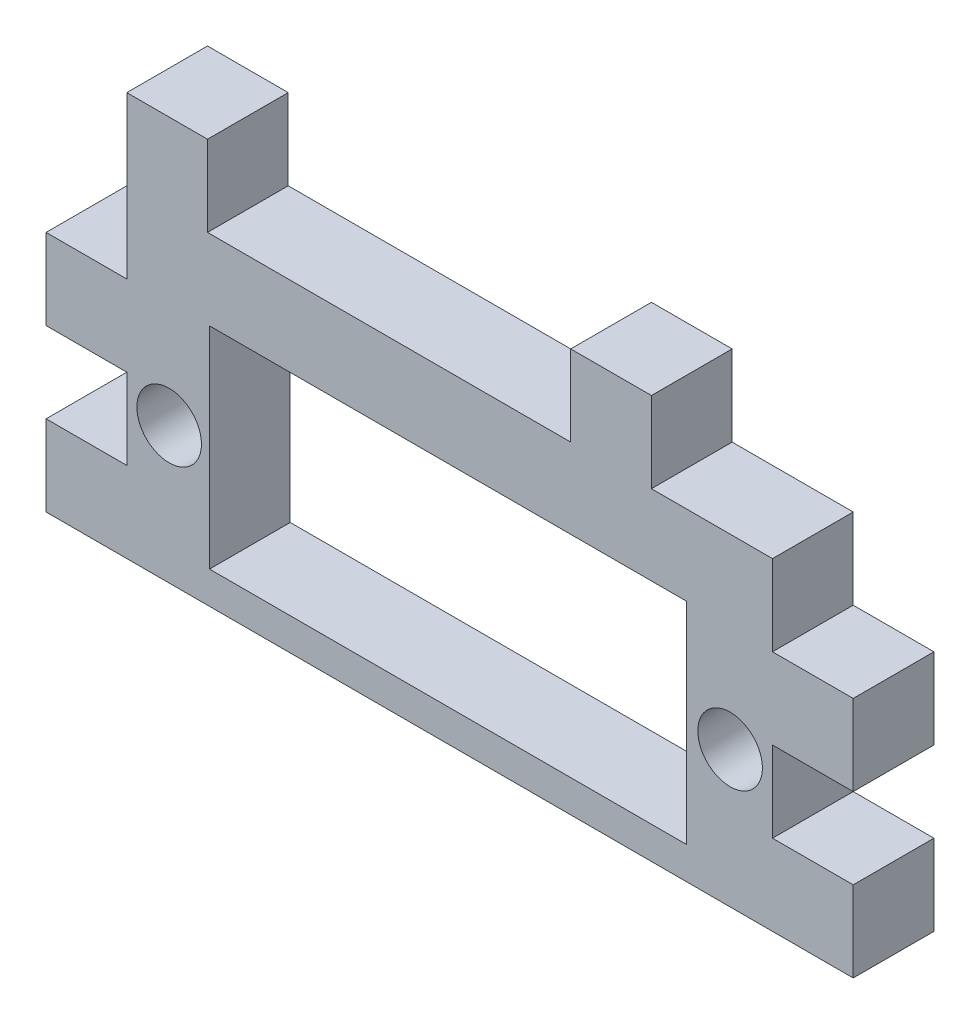
ISO-10303-21;
HEADER;
FILE_DESCRIPTION(('STEP AP214'),'2;1');
FILE_NAME('part.step','',(''),(''),'','','');
FILE_SCHEMA(('AUTOMOTIVE_DESIGN { 1 0 10303 214 1 1 1 1 }'));
ENDSEC;
DATA;
#1=APPLICATION_CONTEXT('core data for automotive mechanical design processes');
#2=APPLICATION_PROTOCOL_DEFINITION('international standard','automotive_design',2000,#1);
#3=PRODUCT_CONTEXT('',#1,'mechanical');
#4=PRODUCT('Part','Part','',(#3));
#5=PRODUCT_RELATED_PRODUCT_CATEGORY('part','',(#4));
#6=PRODUCT_DEFINITION_FORMATION('','',#4);
#7=PRODUCT_DEFINITION_CONTEXT('part definition',#1,'design');
#8=PRODUCT_DEFINITION('design','',#6,#7);
#9=PRODUCT_DEFINITION_SHAPE('','',#8);
#10=(LENGTH_UNIT() NAMED_UNIT(*) SI_UNIT(.MILLI.,.METRE.));
#11=(NAMED_UNIT(*) PLANE_ANGLE_UNIT() SI_UNIT($,.RADIAN.));
#12=(NAMED_UNIT(*) SI_UNIT($,.STERADIAN.) SOLID_ANGLE_UNIT());
#13=UNCERTAINTY_MEASURE_WITH_UNIT(LENGTH_MEASURE(1.E-05),#10,'distance_accuracy_value','');
#14=(GEOMETRIC_REPRESENTATION_CONTEXT(3) GLOBAL_UNCERTAINTY_ASSIGNED_CONTEXT((#13)) GLOBAL_UNIT_ASSIGNED_CONTEXT((#10,
#11,#12)) REPRESENTATION_CONTEXT('',''));
#15=CARTESIAN_POINT('',(0.,0.,0.));
#16=DIRECTION('',(0.,0.,1.));
#17=DIRECTION('',(1.,0.,0.));
#18=AXIS2_PLACEMENT_3D('',#15,#16,#17);
#19=CARTESIAN_POINT('',(-66.021610088224,-17.9075757575758,5.));
#20=DIRECTION('',(0.,-1.,0.));
#21=DIRECTION('',(1.,0.,0.));
#22=AXIS2_PLACEMENT_3D('',#19,#20,#21);
#23=PLANE('',#22);
#24=DIRECTION('',(0.,0.,1.));
#25=VECTOR('',#24,1.);
#26=CARTESIAN_POINT('',(-58.521610088224,-17.9075757575758,0.));
#27=LINE('',#26,#25);
#28=CARTESIAN_POINT('',(-58.521610088224,-17.9075757575758,0.));
#29=VERTEX_POINT('',#28);
#30=CARTESIAN_POINT('',(-58.521610088224,-17.9075757575758,5.));
#31=VERTEX_POINT('',#30);
#32=EDGE_CURVE('E231',#29,#31,#27,.T.);
#33=ORIENTED_EDGE('',*,*,#32,.F.);
#34=DIRECTION('',(-1.,0.,0.));
#35=VECTOR('',#34,1.);
#36=CARTESIAN_POINT('',(-66.021610088224,-17.9075757575758,0.));
#37=LINE('',#36,#35);
#38=CARTESIAN_POINT('',(-81.021610088224,-17.9075757575758,0.));
#39=VERTEX_POINT('',#38);
#40=EDGE_CURVE('E266',#29,#39,#37,.T.);
#41=ORIENTED_EDGE('',*,*,#40,.T.);
#42=DIRECTION('',(0.,0.,-1.));
#43=VECTOR('',#42,1.);
#44=CARTESIAN_POINT('',(-81.021610088224,-17.9075757575758,0.));
#45=LINE('',#44,#43);
#46=CARTESIAN_POINT('',(-81.021610088224,-17.9075757575758,5.));
#47=VERTEX_POINT('',#46);
#48=EDGE_CURVE('E232',#47,#39,#45,.T.);
#49=ORIENTED_EDGE('',*,*,#48,.F.);
#50=DIRECTION('',(-1.,0.,0.));
#51=VECTOR('',#50,1.);
#52=CARTESIAN_POINT('',(-66.021610088224,-17.9075757575758,5.));
#53=LINE('',#52,#51);
#54=EDGE_CURVE('E36',#31,#47,#53,.T.);
#55=ORIENTED_EDGE('',*,*,#54,.F.);
#56=EDGE_LOOP('',(#33,#41,#49,#55));
#57=FACE_BOUND('',#56,.T.);
#58=ADVANCED_FACE('F32',(#57),#23,.F.);
#59=DIRECTION('',(0.,0.,-1.));
#60=VECTOR('',#59,1.);
#61=CARTESIAN_POINT('',(-53.521610088224,-17.9075757575758,0.));
#62=LINE('',#61,#60);
#63=CARTESIAN_POINT('',(-53.521610088224,-17.9075757575758,5.));
#64=VERTEX_POINT('',#63);
#65=CARTESIAN_POINT('',(-53.521610088224,-17.9075757575758,0.));
#66=VERTEX_POINT('',#65);
#67=EDGE_CURVE('E57',#64,#66,#62,.T.);
#68=ORIENTED_EDGE('',*,*,#67,.F.);
#69=CARTESIAN_POINT('',(-46.021610088224,-17.9075757575758,5.));
#70=VERTEX_POINT('',#69);
#71=EDGE_CURVE('E272',#70,#64,#53,.T.);
#72=ORIENTED_EDGE('',*,*,#71,.F.);
#73=DIRECTION('',(0.,0.,-1.));
#74=VECTOR('',#73,1.);
#75=CARTESIAN_POINT('',(-46.021610088224,-17.9075757575758,5.));
#76=LINE('',#75,#74);
#77=CARTESIAN_POINT('',(-46.021610088224,-17.9075757575758,0.));
#78=VERTEX_POINT('',#77);
#79=EDGE_CURVE('E293',#70,#78,#76,.T.);
#80=ORIENTED_EDGE('',*,*,#79,.T.);
#81=EDGE_CURVE('E268',#78,#66,#37,.T.);
#82=ORIENTED_EDGE('',*,*,#81,.T.);
#83=EDGE_LOOP('',(#68,#72,#80,#82));
#84=FACE_BOUND('',#83,.T.);
#85=ADVANCED_FACE('F499',(#84),#23,.F.);
#86=CARTESIAN_POINT('',(0.,0.,5.));
#87=DIRECTION('',(0.,0.,1.));
#88=DIRECTION('',(1.,0.,0.));
#89=AXIS2_PLACEMENT_3D('',#86,#87,#88);
#90=PLANE('',#89);
#91=CARTESIAN_POINT('',(-48.646610088224,-29.4575757575758,5.));
#92=DIRECTION('',(0.,0.,1.));
#93=DIRECTION('',(1.,0.,0.));
#94=AXIS2_PLACEMENT_3D('',#91,#92,#93);
#95=CIRCLE('',#94,2.);
#96=CARTESIAN_POINT('',(-46.646610088224,-29.4575757575758,5.));
#97=VERTEX_POINT('',#96);
#98=EDGE_CURVE('E465',#97,#97,#95,.F.);
#99=ORIENTED_EDGE('',*,*,#98,.T.);
#100=EDGE_LOOP('',(#99));
#101=FACE_BOUND('',#100,.T.);
#102=CARTESIAN_POINT('',(-83.396610088224,-29.4575757575758,5.));
#103=DIRECTION('',(0.,0.,1.));
#104=DIRECTION('',(1.,0.,0.));
#105=AXIS2_PLACEMENT_3D('',#102,#103,#104);
#106=CIRCLE('',#105,2.);
#107=CARTESIAN_POINT('',(-81.396610088224,-29.4575757575758,5.));
#108=VERTEX_POINT('',#107);
#109=EDGE_CURVE('E454',#108,#108,#106,.F.);
#110=ORIENTED_EDGE('',*,*,#109,.T.);
#111=EDGE_LOOP('',(#110));
#112=FACE_BOUND('',#111,.T.);
#113=DIRECTION('',(1.,0.,0.));
#114=VECTOR('',#113,1.);
#115=CARTESIAN_POINT('',(-80.896610088224,-22.8575757575758,5.));
#116=LINE('',#115,#114);
#117=CARTESIAN_POINT('',(-80.896610088224,-22.8575757575758,5.));
#118=VERTEX_POINT('',#117);
#119=CARTESIAN_POINT('',(-51.346610088224,-22.8575757575758,5.));
#120=VERTEX_POINT('',#119);
#121=EDGE_CURVE('E434',#118,#120,#116,.T.);
#122=ORIENTED_EDGE('',*,*,#121,.T.);
#123=DIRECTION('',(0.,-1.,0.));
#124=VECTOR('',#123,1.);
#125=CARTESIAN_POINT('',(-51.346610088224,-35.9075757575758,5.));
#126=LINE('',#125,#124);
#127=CARTESIAN_POINT('',(-51.346610088224,-35.9075757575758,5.));
#128=VERTEX_POINT('',#127);
#129=EDGE_CURVE('E433',#120,#128,#126,.T.);
#130=ORIENTED_EDGE('',*,*,#129,.T.);
#131=DIRECTION('',(-1.,0.,0.));
#132=VECTOR('',#131,1.);
#133=CARTESIAN_POINT('',(-80.896610088224,-35.9075757575758,5.));
#134=LINE('',#133,#132);
#135=CARTESIAN_POINT('',(-80.896610088224,-35.9075757575758,5.));
#136=VERTEX_POINT('',#135);
#137=EDGE_CURVE('E437',#128,#136,#134,.T.);
#138=ORIENTED_EDGE('',*,*,#137,.T.);
#139=DIRECTION('',(0.,1.,0.));
#140=VECTOR('',#139,1.);
#141=CARTESIAN_POINT('',(-80.896610088224,-35.9075757575758,5.));
#142=LINE('',#141,#140);
#143=EDGE_CURVE('E430',#136,#118,#142,.T.);
#144=ORIENTED_EDGE('',*,*,#143,.T.);
#145=EDGE_LOOP('',(#122,#130,#138,#144));
#146=FACE_BOUND('',#145,.T.);
#147=DIRECTION('',(0.,1.,0.));
#148=VECTOR('',#147,1.);
#149=CARTESIAN_POINT('',(-86.021610088224,-17.9075757575758,5.));
#150=LINE('',#149,#148);
#151=CARTESIAN_POINT('',(-86.021610088224,-22.9075757575758,5.));
#152=VERTEX_POINT('',#151);
#153=CARTESIAN_POINT('',(-86.021610088224,-12.9075757575758,5.));
#154=VERTEX_POINT('',#153);
#155=EDGE_CURVE('E423',#152,#154,#150,.T.);
#156=ORIENTED_EDGE('',*,*,#155,.F.);
#157=DIRECTION('',(1.,0.,0.));
#158=VECTOR('',#157,1.);
#159=CARTESIAN_POINT('',(-86.021610088224,-22.9075757575758,5.));
#160=LINE('',#159,#158);
#161=CARTESIAN_POINT('',(-91.021610088224,-22.9075757575758,5.));
#162=VERTEX_POINT('',#161);
#163=EDGE_CURVE('E418',#162,#152,#160,.T.);
#164=ORIENTED_EDGE('',*,*,#163,.F.);
#165=DIRECTION('',(0.,1.,0.));
#166=VECTOR('',#165,1.);
#167=CARTESIAN_POINT('',(-91.021610088224,-12.9075757575758,5.));
#168=LINE('',#167,#166);
#169=CARTESIAN_POINT('',(-91.021610088224,-27.9075757575758,5.));
#170=VERTEX_POINT('',#169);
#171=EDGE_CURVE('E379',#170,#162,#168,.T.);
#172=ORIENTED_EDGE('',*,*,#171,.F.);
#173=DIRECTION('',(-1.,0.,0.));
#174=VECTOR('',#173,1.);
#175=CARTESIAN_POINT('',(-91.0216100882241,-27.9075757575758,5.));
#176=LINE('',#175,#174);
#177=CARTESIAN_POINT('',(-86.0216100882241,-27.9075757575758,5.));
#178=VERTEX_POINT('',#177);
#179=EDGE_CURVE('E405',#178,#170,#176,.T.);
#180=ORIENTED_EDGE('',*,*,#179,.F.);
#181=DIRECTION('',(0.,1.,0.));
#182=VECTOR('',#181,1.);
#183=CARTESIAN_POINT('',(-86.021610088224,-32.9075757575758,5.));
#184=LINE('',#183,#182);
#185=CARTESIAN_POINT('',(-86.021610088224,-32.9075757575758,5.));
#186=VERTEX_POINT('',#185);
#187=EDGE_CURVE('E402',#186,#178,#184,.T.);
#188=ORIENTED_EDGE('',*,*,#187,.F.);
#189=DIRECTION('',(1.,0.,0.));
#190=VECTOR('',#189,1.);
#191=CARTESIAN_POINT('',(-91.0216100882241,-32.9075757575758,5.));
#192=LINE('',#191,#190);
#193=CARTESIAN_POINT('',(-91.0216100882241,-32.9075757575758,5.));
#194=VERTEX_POINT('',#193);
#195=EDGE_CURVE('E397',#194,#186,#192,.T.);
#196=ORIENTED_EDGE('',*,*,#195,.F.);
#197=CARTESIAN_POINT('',(-91.021610088224,-37.9075757575758,5.));
#198=VERTEX_POINT('',#197);
#199=EDGE_CURVE('E367',#198,#194,#168,.T.);
#200=ORIENTED_EDGE('',*,*,#199,.F.);
#201=DIRECTION('',(1.,0.,0.));
#202=VECTOR('',#201,1.);
#203=CARTESIAN_POINT('',(-66.021610088224,-37.9075757575758,5.));
#204=LINE('',#203,#202);
#205=CARTESIAN_POINT('',(-41.021610088224,-37.9075757575758,5.));
#206=VERTEX_POINT('',#205);
#207=EDGE_CURVE('E323',#198,#206,#204,.T.);
#208=ORIENTED_EDGE('',*,*,#207,.T.);
#209=DIRECTION('',(0.,1.,0.));
#210=VECTOR('',#209,1.);
#211=CARTESIAN_POINT('',(-41.021610088224,-12.9075757575758,5.));
#212=LINE('',#211,#210);
#213=CARTESIAN_POINT('',(-41.021610088224,-32.9075757575758,5.));
#214=VERTEX_POINT('',#213);
#215=EDGE_CURVE('E42',#206,#214,#212,.T.);
#216=ORIENTED_EDGE('',*,*,#215,.T.);
#217=DIRECTION('',(-1.,0.,0.));
#218=VECTOR('',#217,1.);
#219=CARTESIAN_POINT('',(-41.021610088224,-32.9075757575758,5.));
#220=LINE('',#219,#218);
#221=CARTESIAN_POINT('',(-46.021610088224,-32.9075757575758,5.));
#222=VERTEX_POINT('',#221);
#223=EDGE_CURVE('E297',#214,#222,#220,.T.);
#224=ORIENTED_EDGE('',*,*,#223,.T.);
#225=DIRECTION('',(0.,1.,0.));
#226=VECTOR('',#225,1.);
#227=CARTESIAN_POINT('',(-46.021610088224,-32.9075757575758,5.));
#228=LINE('',#227,#226);
#229=CARTESIAN_POINT('',(-46.021610088224,-27.9075757575758,5.));
#230=VERTEX_POINT('',#229);
#231=EDGE_CURVE('E300',#222,#230,#228,.T.);
#232=ORIENTED_EDGE('',*,*,#231,.T.);
#233=DIRECTION('',(1.,0.,0.));
#234=VECTOR('',#233,1.);
#235=CARTESIAN_POINT('',(-41.021610088224,-27.9075757575758,5.));
#236=LINE('',#235,#234);
#237=CARTESIAN_POINT('',(-41.021610088224,-27.9075757575758,5.));
#238=VERTEX_POINT('',#237);
#239=EDGE_CURVE('E304',#230,#238,#236,.T.);
#240=ORIENTED_EDGE('',*,*,#239,.T.);
#241=CARTESIAN_POINT('',(-41.021610088224,-22.9075757575758,5.));
#242=VERTEX_POINT('',#241);
#243=EDGE_CURVE('E325',#238,#242,#212,.T.);
#244=ORIENTED_EDGE('',*,*,#243,.T.);
#245=DIRECTION('',(-1.,0.,0.));
#246=VECTOR('',#245,1.);
#247=CARTESIAN_POINT('',(-46.021610088224,-22.9075757575758,5.));
#248=LINE('',#247,#246);
#249=CARTESIAN_POINT('',(-46.021610088224,-22.9075757575758,5.));
#250=VERTEX_POINT('',#249);
#251=EDGE_CURVE('E280',#242,#250,#248,.T.);
#252=ORIENTED_EDGE('',*,*,#251,.T.);
#253=DIRECTION('',(0.,1.,0.));
#254=VECTOR('',#253,1.);
#255=CARTESIAN_POINT('',(-46.021610088224,-17.9075757575758,5.));
#256=LINE('',#255,#254);
#257=EDGE_CURVE('E278',#250,#70,#256,.T.);
#258=ORIENTED_EDGE('',*,*,#257,.T.);
#259=ORIENTED_EDGE('',*,*,#71,.T.);
#260=DIRECTION('',(0.,-1.,0.));
#261=VECTOR('',#260,1.);
#262=CARTESIAN_POINT('',(-53.521610088224,-12.9075757575758,5.));
#263=LINE('',#262,#261);
#264=CARTESIAN_POINT('',(-53.521610088224,-12.9075757575758,5.));
#265=VERTEX_POINT('',#264);
#266=EDGE_CURVE('E216',#265,#64,#263,.T.);
#267=ORIENTED_EDGE('',*,*,#266,.F.);
#268=DIRECTION('',(1.,0.,0.));
#269=VECTOR('',#268,1.);
#270=CARTESIAN_POINT('',(-58.521610088224,-12.9075757575758,5.));
#271=LINE('',#270,#269);
#272=CARTESIAN_POINT('',(-58.521610088224,-12.9075757575758,5.));
#273=VERTEX_POINT('',#272);
#274=EDGE_CURVE('E208',#273,#265,#271,.T.);
#275=ORIENTED_EDGE('',*,*,#274,.F.);
#276=DIRECTION('',(0.,-1.,0.));
#277=VECTOR('',#276,1.);
#278=CARTESIAN_POINT('',(-58.521610088224,-12.9075757575758,5.));
#279=LINE('',#278,#277);
#280=EDGE_CURVE('E213',#273,#31,#279,.T.);
#281=ORIENTED_EDGE('',*,*,#280,.T.);
#282=ORIENTED_EDGE('',*,*,#54,.T.);
#283=DIRECTION('',(0.,-1.,0.));
#284=VECTOR('',#283,1.);
#285=CARTESIAN_POINT('',(-81.021610088224,-12.9075757575758,5.));
#286=LINE('',#285,#284);
#287=CARTESIAN_POINT('',(-81.021610088224,-12.9075757575758,5.));
#288=VERTEX_POINT('',#287);
#289=EDGE_CURVE('E260',#288,#47,#286,.T.);
#290=ORIENTED_EDGE('',*,*,#289,.F.);
#291=DIRECTION('',(1.,0.,0.));
#292=VECTOR('',#291,1.);
#293=CARTESIAN_POINT('',(-86.021610088224,-12.9075757575758,5.));
#294=LINE('',#293,#292);
#295=EDGE_CURVE('E243',#154,#288,#294,.T.);
#296=ORIENTED_EDGE('',*,*,#295,.F.);
#297=EDGE_LOOP('',(#156,#164,#172,#180,#188,#196,#200,#208,#216,#224,#232,#240,#244,#252,#258,
#259,#267,#275,#281,#282,#290,#296));
#298=FACE_BOUND('',#297,.T.);
#299=ADVANCED_FACE('F211',(#101,#112,#146,#298),#90,.T.);
#300=CARTESIAN_POINT('',(0.,0.,0.));
#301=DIRECTION('',(0.,0.,1.));
#302=DIRECTION('',(1.,0.,0.));
#303=AXIS2_PLACEMENT_3D('',#300,#301,#302);
#304=PLANE('',#303);
#305=CARTESIAN_POINT('',(-48.646610088224,-29.4575757575758,0.));
#306=DIRECTION('',(0.,0.,-1.));
#307=DIRECTION('',(-1.,0.,0.));
#308=AXIS2_PLACEMENT_3D('',#305,#306,#307);
#309=CIRCLE('',#308,2.);
#310=CARTESIAN_POINT('',(-50.646610088224,-29.4575757575758,0.));
#311=VERTEX_POINT('',#310);
#312=EDGE_CURVE('E253',#311,#311,#309,.T.);
#313=ORIENTED_EDGE('',*,*,#312,.F.);
#314=EDGE_LOOP('',(#313));
#315=FACE_BOUND('',#314,.T.);
#316=CARTESIAN_POINT('',(-83.396610088224,-29.4575757575758,0.));
#317=DIRECTION('',(0.,0.,-1.));
#318=DIRECTION('',(-1.,0.,0.));
#319=AXIS2_PLACEMENT_3D('',#316,#317,#318);
#320=CIRCLE('',#319,2.);
#321=CARTESIAN_POINT('',(-85.396610088224,-29.4575757575758,0.));
#322=VERTEX_POINT('',#321);
#323=EDGE_CURVE('E463',#322,#322,#320,.T.);
#324=ORIENTED_EDGE('',*,*,#323,.F.);
#325=EDGE_LOOP('',(#324));
#326=FACE_BOUND('',#325,.T.);
#327=DIRECTION('',(0.,-1.,0.));
#328=VECTOR('',#327,1.);
#329=CARTESIAN_POINT('',(-51.346610088224,-35.9075757575758,0.));
#330=LINE('',#329,#328);
#331=CARTESIAN_POINT('',(-51.346610088224,-22.8575757575758,0.));
#332=VERTEX_POINT('',#331);
#333=CARTESIAN_POINT('',(-51.346610088224,-35.9075757575758,0.));
#334=VERTEX_POINT('',#333);
#335=EDGE_CURVE('E457',#332,#334,#330,.T.);
#336=ORIENTED_EDGE('',*,*,#335,.F.);
#337=DIRECTION('',(1.,0.,0.));
#338=VECTOR('',#337,1.);
#339=CARTESIAN_POINT('',(-80.896610088224,-22.8575757575758,0.));
#340=LINE('',#339,#338);
#341=CARTESIAN_POINT('',(-80.896610088224,-22.8575757575758,0.));
#342=VERTEX_POINT('',#341);
#343=EDGE_CURVE('E453',#342,#332,#340,.T.);
#344=ORIENTED_EDGE('',*,*,#343,.F.);
#345=DIRECTION('',(0.,1.,0.));
#346=VECTOR('',#345,1.);
#347=CARTESIAN_POINT('',(-80.896610088224,-35.9075757575758,0.));
#348=LINE('',#347,#346);
#349=CARTESIAN_POINT('',(-80.896610088224,-35.9075757575758,0.));
#350=VERTEX_POINT('',#349);
#351=EDGE_CURVE('E450',#350,#342,#348,.T.);
#352=ORIENTED_EDGE('',*,*,#351,.F.);
#353=DIRECTION('',(-1.,0.,0.));
#354=VECTOR('',#353,1.);
#355=CARTESIAN_POINT('',(-80.896610088224,-35.9075757575758,0.));
#356=LINE('',#355,#354);
#357=EDGE_CURVE('E449',#334,#350,#356,.T.);
#358=ORIENTED_EDGE('',*,*,#357,.F.);
#359=EDGE_LOOP('',(#336,#344,#352,#358));
#360=FACE_BOUND('',#359,.T.);
#361=DIRECTION('',(1.,0.,0.));
#362=VECTOR('',#361,1.);
#363=CARTESIAN_POINT('',(-86.021610088224,-22.9075757575758,0.));
#364=LINE('',#363,#362);
#365=CARTESIAN_POINT('',(-91.021610088224,-22.9075757575758,0.));
#366=VERTEX_POINT('',#365);
#367=CARTESIAN_POINT('',(-86.021610088224,-22.9075757575758,0.));
#368=VERTEX_POINT('',#367);
#369=EDGE_CURVE('E421',#366,#368,#364,.T.);
#370=ORIENTED_EDGE('',*,*,#369,.T.);
#371=DIRECTION('',(0.,1.,0.));
#372=VECTOR('',#371,1.);
#373=CARTESIAN_POINT('',(-86.021610088224,-17.9075757575758,0.));
#374=LINE('',#373,#372);
#375=CARTESIAN_POINT('',(-86.021610088224,-12.9075757575758,0.));
#376=VERTEX_POINT('',#375);
#377=EDGE_CURVE('E424',#368,#376,#374,.T.);
#378=ORIENTED_EDGE('',*,*,#377,.T.);
#379=DIRECTION('',(-1.,0.,0.));
#380=VECTOR('',#379,1.);
#381=CARTESIAN_POINT('',(-86.021610088224,-12.9075757575758,0.));
#382=LINE('',#381,#380);
#383=CARTESIAN_POINT('',(-81.021610088224,-12.9075757575758,0.));
#384=VERTEX_POINT('',#383);
#385=EDGE_CURVE('E247',#384,#376,#382,.T.);
#386=ORIENTED_EDGE('',*,*,#385,.F.);
#387=DIRECTION('',(0.,-1.,0.));
#388=VECTOR('',#387,1.);
#389=CARTESIAN_POINT('',(-81.021610088224,-12.9075757575758,0.));
#390=LINE('',#389,#388);
#391=EDGE_CURVE('E250',#384,#39,#390,.T.);
#392=ORIENTED_EDGE('',*,*,#391,.T.);
#393=ORIENTED_EDGE('',*,*,#40,.F.);
#394=DIRECTION('',(0.,-1.,0.));
#395=VECTOR('',#394,1.);
#396=CARTESIAN_POINT('',(-58.521610088224,-12.9075757575758,0.));
#397=LINE('',#396,#395);
#398=CARTESIAN_POINT('',(-58.521610088224,-12.9075757575758,0.));
#399=VERTEX_POINT('',#398);
#400=EDGE_CURVE('E779',#399,#29,#397,.T.);
#401=ORIENTED_EDGE('',*,*,#400,.F.);
#402=DIRECTION('',(-1.,0.,0.));
#403=VECTOR('',#402,1.);
#404=CARTESIAN_POINT('',(-58.521610088224,-12.9075757575758,0.));
#405=LINE('',#404,#403);
#406=CARTESIAN_POINT('',(-53.521610088224,-12.9075757575758,0.));
#407=VERTEX_POINT('',#406);
#408=EDGE_CURVE('E225',#407,#399,#405,.T.);
#409=ORIENTED_EDGE('',*,*,#408,.F.);
#410=DIRECTION('',(0.,-1.,0.));
#411=VECTOR('',#410,1.);
#412=CARTESIAN_POINT('',(-53.521610088224,-12.9075757575758,0.));
#413=LINE('',#412,#411);
#414=EDGE_CURVE('E237',#407,#66,#413,.T.);
#415=ORIENTED_EDGE('',*,*,#414,.T.);
#416=ORIENTED_EDGE('',*,*,#81,.F.);
#417=DIRECTION('',(0.,1.,0.));
#418=VECTOR('',#417,1.);
#419=CARTESIAN_POINT('',(-46.021610088224,-17.9075757575758,0.));
#420=LINE('',#419,#418);
#421=CARTESIAN_POINT('',(-46.021610088224,-22.9075757575758,0.));
#422=VERTEX_POINT('',#421);
#423=EDGE_CURVE('E269',#422,#78,#420,.T.);
#424=ORIENTED_EDGE('',*,*,#423,.F.);
#425=DIRECTION('',(-1.,0.,0.));
#426=VECTOR('',#425,1.);
#427=CARTESIAN_POINT('',(-46.021610088224,-22.9075757575758,0.));
#428=LINE('',#427,#426);
#429=CARTESIAN_POINT('',(-41.021610088224,-22.9075757575758,0.));
#430=VERTEX_POINT('',#429);
#431=EDGE_CURVE('E287',#430,#422,#428,.T.);
#432=ORIENTED_EDGE('',*,*,#431,.F.);
#433=DIRECTION('',(0.,1.,0.));
#434=VECTOR('',#433,1.);
#435=CARTESIAN_POINT('',(-41.021610088224,-12.9075757575758,0.));
#436=LINE('',#435,#434);
#437=CARTESIAN_POINT('',(-41.021610088224,-27.9075757575758,0.));
#438=VERTEX_POINT('',#437);
#439=EDGE_CURVE('E330',#438,#430,#436,.T.);
#440=ORIENTED_EDGE('',*,*,#439,.F.);
#441=DIRECTION('',(1.,0.,0.));
#442=VECTOR('',#441,1.);
#443=CARTESIAN_POINT('',(-41.021610088224,-27.9075757575758,0.));
#444=LINE('',#443,#442);
#445=CARTESIAN_POINT('',(-46.021610088224,-27.9075757575758,0.));
#446=VERTEX_POINT('',#445);
#447=EDGE_CURVE('E301',#446,#438,#444,.T.);
#448=ORIENTED_EDGE('',*,*,#447,.F.);
#449=DIRECTION('',(0.,1.,0.));
#450=VECTOR('',#449,1.);
#451=CARTESIAN_POINT('',(-46.021610088224,-32.9075757575758,0.));
#452=LINE('',#451,#450);
#453=CARTESIAN_POINT('',(-46.021610088224,-32.9075757575758,0.));
#454=VERTEX_POINT('',#453);
#455=EDGE_CURVE('E310',#454,#446,#452,.T.);
#456=ORIENTED_EDGE('',*,*,#455,.F.);
#457=DIRECTION('',(-1.,0.,0.));
#458=VECTOR('',#457,1.);
#459=CARTESIAN_POINT('',(-41.021610088224,-32.9075757575758,0.));
#460=LINE('',#459,#458);
#461=CARTESIAN_POINT('',(-41.021610088224,-32.9075757575758,0.));
#462=VERTEX_POINT('',#461);
#463=EDGE_CURVE('E295',#462,#454,#460,.T.);
#464=ORIENTED_EDGE('',*,*,#463,.F.);
#465=CARTESIAN_POINT('',(-41.021610088224,-37.9075757575758,0.));
#466=VERTEX_POINT('',#465);
#467=EDGE_CURVE('E326',#466,#462,#436,.T.);
#468=ORIENTED_EDGE('',*,*,#467,.F.);
#469=DIRECTION('',(1.,0.,0.));
#470=VECTOR('',#469,1.);
#471=CARTESIAN_POINT('',(-66.021610088224,-37.9075757575758,0.));
#472=LINE('',#471,#470);
#473=CARTESIAN_POINT('',(-91.021610088224,-37.9075757575758,0.));
#474=VERTEX_POINT('',#473);
#475=EDGE_CURVE('E317',#474,#466,#472,.T.);
#476=ORIENTED_EDGE('',*,*,#475,.F.);
#477=DIRECTION('',(0.,1.,0.));
#478=VECTOR('',#477,1.);
#479=CARTESIAN_POINT('',(-91.021610088224,-12.9075757575758,0.));
#480=LINE('',#479,#478);
#481=CARTESIAN_POINT('',(-91.0216100882241,-32.9075757575758,0.));
#482=VERTEX_POINT('',#481);
#483=EDGE_CURVE('E374',#474,#482,#480,.T.);
#484=ORIENTED_EDGE('',*,*,#483,.T.);
#485=DIRECTION('',(1.,0.,0.));
#486=VECTOR('',#485,1.);
#487=CARTESIAN_POINT('',(-91.0216100882241,-32.9075757575758,0.));
#488=LINE('',#487,#486);
#489=CARTESIAN_POINT('',(-86.021610088224,-32.9075757575758,0.));
#490=VERTEX_POINT('',#489);
#491=EDGE_CURVE('E376',#482,#490,#488,.T.);
#492=ORIENTED_EDGE('',*,*,#491,.T.);
#493=DIRECTION('',(0.,1.,0.));
#494=VECTOR('',#493,1.);
#495=CARTESIAN_POINT('',(-86.021610088224,-32.9075757575758,0.));
#496=LINE('',#495,#494);
#497=CARTESIAN_POINT('',(-86.0216100882241,-27.9075757575758,0.));
#498=VERTEX_POINT('',#497);
#499=EDGE_CURVE('E410',#490,#498,#496,.T.);
#500=ORIENTED_EDGE('',*,*,#499,.T.);
#501=DIRECTION('',(-1.,0.,0.));
#502=VECTOR('',#501,1.);
#503=CARTESIAN_POINT('',(-91.0216100882241,-27.9075757575758,0.));
#504=LINE('',#503,#502);
#505=CARTESIAN_POINT('',(-91.0216100882241,-27.9075757575758,0.));
#506=VERTEX_POINT('',#505);
#507=EDGE_CURVE('E409',#498,#506,#504,.T.);
#508=ORIENTED_EDGE('',*,*,#507,.T.);
#509=EDGE_CURVE('E380',#506,#366,#480,.T.);
#510=ORIENTED_EDGE('',*,*,#509,.T.);
#511=EDGE_LOOP('',(#370,#378,#386,#392,#393,#401,#409,#415,#416,#424,#432,#440,#448,#456,#464,
#468,#476,#484,#492,#500,#508,#510));
#512=FACE_BOUND('',#511,.T.);
#513=ADVANCED_FACE('F346',(#315,#326,#360,#512),#304,.F.);
#514=CARTESIAN_POINT('',(-91.021610088224,-12.9075757575758,5.));
#515=DIRECTION('',(-1.,0.,0.));
#516=DIRECTION('',(0.,-1.,0.));
#517=AXIS2_PLACEMENT_3D('',#514,#515,#516);
#518=PLANE('',#517);
#519=ORIENTED_EDGE('',*,*,#171,.T.);
#520=DIRECTION('',(0.,0.,-1.));
#521=VECTOR('',#520,1.);
#522=CARTESIAN_POINT('',(-91.021610088224,-22.9075757575758,5.));
#523=LINE('',#522,#521);
#524=EDGE_CURVE('E411',#162,#366,#523,.T.);
#525=ORIENTED_EDGE('',*,*,#524,.T.);
#526=ORIENTED_EDGE('',*,*,#509,.F.);
#527=DIRECTION('',(0.,0.,-1.));
#528=VECTOR('',#527,1.);
#529=CARTESIAN_POINT('',(-91.0216100882241,-27.9075757575758,5.));
#530=LINE('',#529,#528);
#531=EDGE_CURVE('E396',#170,#506,#530,.T.);
#532=ORIENTED_EDGE('',*,*,#531,.F.);
#533=EDGE_LOOP('',(#519,#525,#526,#532));
#534=FACE_BOUND('',#533,.T.);
#535=ADVANCED_FACE('F477',(#534),#518,.T.);
#536=ORIENTED_EDGE('',*,*,#199,.T.);
#537=DIRECTION('',(0.,0.,-1.));
#538=VECTOR('',#537,1.);
#539=CARTESIAN_POINT('',(-91.0216100882241,-32.9075757575758,5.));
#540=LINE('',#539,#538);
#541=EDGE_CURVE('E385',#194,#482,#540,.T.);
#542=ORIENTED_EDGE('',*,*,#541,.T.);
#543=ORIENTED_EDGE('',*,*,#483,.F.);
#544=DIRECTION('',(0.,0.,-1.));
#545=VECTOR('',#544,1.);
#546=CARTESIAN_POINT('',(-91.021610088224,-37.9075757575758,5.));
#547=LINE('',#546,#545);
#548=EDGE_CURVE('E290',#198,#474,#547,.T.);
#549=ORIENTED_EDGE('',*,*,#548,.F.);
#550=EDGE_LOOP('',(#536,#542,#543,#549));
#551=FACE_BOUND('',#550,.T.);
#552=ADVANCED_FACE('F387',(#551),#518,.T.);
#553=CARTESIAN_POINT('',(-41.021610088224,-12.9075757575758,5.));
#554=DIRECTION('',(-1.,0.,0.));
#555=DIRECTION('',(0.,-1.,0.));
#556=AXIS2_PLACEMENT_3D('',#553,#554,#555);
#557=PLANE('',#556);
#558=ORIENTED_EDGE('',*,*,#439,.T.);
#559=DIRECTION('',(0.,0.,-1.));
#560=VECTOR('',#559,1.);
#561=CARTESIAN_POINT('',(-41.021610088224,-22.9075757575758,5.));
#562=LINE('',#561,#560);
#563=EDGE_CURVE('E274',#242,#430,#562,.T.);
#564=ORIENTED_EDGE('',*,*,#563,.F.);
#565=ORIENTED_EDGE('',*,*,#243,.F.);
#566=DIRECTION('',(0.,0.,-1.));
#567=VECTOR('',#566,1.);
#568=CARTESIAN_POINT('',(-41.021610088224,-27.9075757575758,5.));
#569=LINE('',#568,#567);
#570=EDGE_CURVE('E314',#238,#438,#569,.T.);
#571=ORIENTED_EDGE('',*,*,#570,.T.);
#572=EDGE_LOOP('',(#558,#564,#565,#571));
#573=FACE_BOUND('',#572,.T.);
#574=ADVANCED_FACE('F339',(#573),#557,.F.);
#575=CARTESIAN_POINT('',(-66.021610088224,-37.9075757575758,5.));
#576=DIRECTION('',(0.,1.,0.));
#577=DIRECTION('',(0.,0.,1.));
#578=AXIS2_PLACEMENT_3D('',#575,#576,#577);
#579=PLANE('',#578);
#580=ORIENTED_EDGE('',*,*,#475,.T.);
#581=DIRECTION('',(0.,0.,-1.));
#582=VECTOR('',#581,1.);
#583=CARTESIAN_POINT('',(-41.021610088224,-37.9075757575758,5.));
#584=LINE('',#583,#582);
#585=EDGE_CURVE('E11',#206,#466,#584,.T.);
#586=ORIENTED_EDGE('',*,*,#585,.F.);
#587=ORIENTED_EDGE('',*,*,#207,.F.);
#588=ORIENTED_EDGE('',*,*,#548,.T.);
#589=EDGE_LOOP('',(#580,#586,#587,#588));
#590=FACE_BOUND('',#589,.T.);
#591=ADVANCED_FACE('F34',(#590),#579,.F.);
#592=ORIENTED_EDGE('',*,*,#467,.T.);
#593=DIRECTION('',(0.,0.,-1.));
#594=VECTOR('',#593,1.);
#595=CARTESIAN_POINT('',(-41.021610088224,-32.9075757575758,5.));
#596=LINE('',#595,#594);
#597=EDGE_CURVE('E307',#214,#462,#596,.T.);
#598=ORIENTED_EDGE('',*,*,#597,.F.);
#599=ORIENTED_EDGE('',*,*,#215,.F.);
#600=ORIENTED_EDGE('',*,*,#585,.T.);
#601=EDGE_LOOP('',(#592,#598,#599,#600));
#602=FACE_BOUND('',#601,.T.);
#603=ADVANCED_FACE('F362',(#602),#557,.F.);
#604=CARTESIAN_POINT('',(-41.021610088224,-27.9075757575758,5.));
#605=DIRECTION('',(0.,1.,0.));
#606=DIRECTION('',(0.,0.,1.));
#607=AXIS2_PLACEMENT_3D('',#604,#605,#606);
#608=PLANE('',#607);
#609=ORIENTED_EDGE('',*,*,#447,.T.);
#610=ORIENTED_EDGE('',*,*,#570,.F.);
#611=ORIENTED_EDGE('',*,*,#239,.F.);
#612=DIRECTION('',(0.,0.,-1.));
#613=VECTOR('',#612,1.);
#614=CARTESIAN_POINT('',(-46.021610088224,-27.9075757575758,5.));
#615=LINE('',#614,#613);
#616=EDGE_CURVE('E318',#230,#446,#615,.T.);
#617=ORIENTED_EDGE('',*,*,#616,.T.);
#618=EDGE_LOOP('',(#609,#610,#611,#617));
#619=FACE_BOUND('',#618,.T.);
#620=ADVANCED_FACE('F355',(#619),#608,.F.);
#621=CARTESIAN_POINT('',(-46.021610088224,-32.9075757575758,5.));
#622=DIRECTION('',(-1.,0.,0.));
#623=DIRECTION('',(0.,-1.,0.));
#624=AXIS2_PLACEMENT_3D('',#621,#622,#623);
#625=PLANE('',#624);
#626=ORIENTED_EDGE('',*,*,#455,.T.);
#627=ORIENTED_EDGE('',*,*,#616,.F.);
#628=ORIENTED_EDGE('',*,*,#231,.F.);
#629=DIRECTION('',(0.,0.,-1.));
#630=VECTOR('',#629,1.);
#631=CARTESIAN_POINT('',(-46.021610088224,-32.9075757575758,5.));
#632=LINE('',#631,#630);
#633=EDGE_CURVE('E320',#222,#454,#632,.T.);
#634=ORIENTED_EDGE('',*,*,#633,.T.);
#635=EDGE_LOOP('',(#626,#627,#628,#634));
#636=FACE_BOUND('',#635,.T.);
#637=ADVANCED_FACE('F357',(#636),#625,.F.);
#638=CARTESIAN_POINT('',(-41.021610088224,-32.9075757575758,5.));
#639=DIRECTION('',(0.,-1.,0.));
#640=DIRECTION('',(0.,0.,-1.));
#641=AXIS2_PLACEMENT_3D('',#638,#639,#640);
#642=PLANE('',#641);
#643=ORIENTED_EDGE('',*,*,#463,.T.);
#644=ORIENTED_EDGE('',*,*,#633,.F.);
#645=ORIENTED_EDGE('',*,*,#223,.F.);
#646=ORIENTED_EDGE('',*,*,#597,.T.);
#647=EDGE_LOOP('',(#643,#644,#645,#646));
#648=FACE_BOUND('',#647,.T.);
#649=ADVANCED_FACE('F360',(#648),#642,.F.);
#650=CARTESIAN_POINT('',(-46.021610088224,-17.9075757575758,5.));
#651=DIRECTION('',(-1.,0.,0.));
#652=DIRECTION('',(0.,0.,1.));
#653=AXIS2_PLACEMENT_3D('',#650,#651,#652);
#654=PLANE('',#653);
#655=ORIENTED_EDGE('',*,*,#423,.T.);
#656=ORIENTED_EDGE('',*,*,#79,.F.);
#657=ORIENTED_EDGE('',*,*,#257,.F.);
#658=DIRECTION('',(0.,0.,-1.));
#659=VECTOR('',#658,1.);
#660=CARTESIAN_POINT('',(-46.021610088224,-22.9075757575758,5.));
#661=LINE('',#660,#659);
#662=EDGE_CURVE('E276',#250,#422,#661,.T.);
#663=ORIENTED_EDGE('',*,*,#662,.T.);
#664=EDGE_LOOP('',(#655,#656,#657,#663));
#665=FACE_BOUND('',#664,.T.);
#666=ADVANCED_FACE('F513',(#665),#654,.F.);
#667=CARTESIAN_POINT('',(-46.021610088224,-22.9075757575758,5.));
#668=DIRECTION('',(0.,-1.,0.));
#669=DIRECTION('',(0.,0.,-1.));
#670=AXIS2_PLACEMENT_3D('',#667,#668,#669);
#671=PLANE('',#670);
#672=ORIENTED_EDGE('',*,*,#431,.T.);
#673=ORIENTED_EDGE('',*,*,#662,.F.);
#674=ORIENTED_EDGE('',*,*,#251,.F.);
#675=ORIENTED_EDGE('',*,*,#563,.T.);
#676=EDGE_LOOP('',(#672,#673,#674,#675));
#677=FACE_BOUND('',#676,.T.);
#678=ADVANCED_FACE('F351',(#677),#671,.F.);
#679=CARTESIAN_POINT('',(-91.0216100882241,-32.9075757575758,5.));
#680=DIRECTION('',(0.,1.,0.));
#681=DIRECTION('',(0.,0.,1.));
#682=AXIS2_PLACEMENT_3D('',#679,#680,#681);
#683=PLANE('',#682);
#684=ORIENTED_EDGE('',*,*,#491,.F.);
#685=ORIENTED_EDGE('',*,*,#541,.F.);
#686=ORIENTED_EDGE('',*,*,#195,.T.);
#687=DIRECTION('',(0.,0.,-1.));
#688=VECTOR('',#687,1.);
#689=CARTESIAN_POINT('',(-86.021610088224,-32.9075757575758,5.));
#690=LINE('',#689,#688);
#691=EDGE_CURVE('E389',#186,#490,#690,.T.);
#692=ORIENTED_EDGE('',*,*,#691,.T.);
#693=EDGE_LOOP('',(#684,#685,#686,#692));
#694=FACE_BOUND('',#693,.T.);
#695=ADVANCED_FACE('F519',(#694),#683,.T.);
#696=CARTESIAN_POINT('',(-86.021610088224,-32.9075757575758,5.));
#697=DIRECTION('',(-1.,0.,0.));
#698=DIRECTION('',(0.,-1.,0.));
#699=AXIS2_PLACEMENT_3D('',#696,#697,#698);
#700=PLANE('',#699);
#701=ORIENTED_EDGE('',*,*,#499,.F.);
#702=ORIENTED_EDGE('',*,*,#691,.F.);
#703=ORIENTED_EDGE('',*,*,#187,.T.);
#704=DIRECTION('',(0.,0.,-1.));
#705=VECTOR('',#704,1.);
#706=CARTESIAN_POINT('',(-86.0216100882241,-27.9075757575758,5.));
#707=LINE('',#706,#705);
#708=EDGE_CURVE('E391',#178,#498,#707,.T.);
#709=ORIENTED_EDGE('',*,*,#708,.T.);
#710=EDGE_LOOP('',(#701,#702,#703,#709));
#711=FACE_BOUND('',#710,.T.);
#712=ADVANCED_FACE('F543',(#711),#700,.T.);
#713=CARTESIAN_POINT('',(-91.0216100882241,-27.9075757575758,5.));
#714=DIRECTION('',(0.,-1.,0.));
#715=DIRECTION('',(0.,0.,-1.));
#716=AXIS2_PLACEMENT_3D('',#713,#714,#715);
#717=PLANE('',#716);
#718=ORIENTED_EDGE('',*,*,#507,.F.);
#719=ORIENTED_EDGE('',*,*,#708,.F.);
#720=ORIENTED_EDGE('',*,*,#179,.T.);
#721=ORIENTED_EDGE('',*,*,#531,.T.);
#722=EDGE_LOOP('',(#718,#719,#720,#721));
#723=FACE_BOUND('',#722,.T.);
#724=ADVANCED_FACE('F551',(#723),#717,.T.);
#725=CARTESIAN_POINT('',(-86.021610088224,-22.9075757575758,5.));
#726=DIRECTION('',(0.,1.,0.));
#727=DIRECTION('',(0.,0.,1.));
#728=AXIS2_PLACEMENT_3D('',#725,#726,#727);
#729=PLANE('',#728);
#730=ORIENTED_EDGE('',*,*,#369,.F.);
#731=ORIENTED_EDGE('',*,*,#524,.F.);
#732=ORIENTED_EDGE('',*,*,#163,.T.);
#733=DIRECTION('',(0.,0.,-1.));
#734=VECTOR('',#733,1.);
#735=CARTESIAN_POINT('',(-86.021610088224,-22.9075757575758,5.));
#736=LINE('',#735,#734);
#737=EDGE_CURVE('E416',#152,#368,#736,.T.);
#738=ORIENTED_EDGE('',*,*,#737,.T.);
#739=EDGE_LOOP('',(#730,#731,#732,#738));
#740=FACE_BOUND('',#739,.T.);
#741=ADVANCED_FACE('F559',(#740),#729,.T.);
#742=CARTESIAN_POINT('',(-86.021610088224,-17.9075757575758,5.));
#743=DIRECTION('',(-1.,0.,0.));
#744=DIRECTION('',(0.,0.,1.));
#745=AXIS2_PLACEMENT_3D('',#742,#743,#744);
#746=PLANE('',#745);
#747=ORIENTED_EDGE('',*,*,#377,.F.);
#748=ORIENTED_EDGE('',*,*,#737,.F.);
#749=ORIENTED_EDGE('',*,*,#155,.T.);
#750=DIRECTION('',(0.,0.,1.));
#751=VECTOR('',#750,1.);
#752=CARTESIAN_POINT('',(-86.021610088224,-12.9075757575758,0.));
#753=LINE('',#752,#751);
#754=EDGE_CURVE('E235',#376,#154,#753,.T.);
#755=ORIENTED_EDGE('',*,*,#754,.F.);
#756=EDGE_LOOP('',(#747,#748,#749,#755));
#757=FACE_BOUND('',#756,.T.);
#758=ADVANCED_FACE('F565',(#757),#746,.T.);
#759=CARTESIAN_POINT('',(-80.896610088224,-22.8575757575758,37.3033280019258));
#760=DIRECTION('',(0.,1.,0.));
#761=DIRECTION('',(-1.,0.,0.));
#762=AXIS2_PLACEMENT_3D('',#759,#760,#761);
#763=PLANE('',#762);
#764=DIRECTION('',(0.,0.,-1.));
#765=VECTOR('',#764,1.);
#766=CARTESIAN_POINT('',(-80.896610088224,-22.8575757575758,37.3033280019258));
#767=LINE('',#766,#765);
#768=EDGE_CURVE('E426',#118,#342,#767,.T.);
#769=ORIENTED_EDGE('',*,*,#768,.T.);
#770=ORIENTED_EDGE('',*,*,#343,.T.);
#771=DIRECTION('',(0.,0.,-1.));
#772=VECTOR('',#771,1.);
#773=CARTESIAN_POINT('',(-51.346610088224,-22.8575757575758,37.3033280019258));
#774=LINE('',#773,#772);
#775=EDGE_CURVE('E431',#120,#332,#774,.T.);
#776=ORIENTED_EDGE('',*,*,#775,.F.);
#777=ORIENTED_EDGE('',*,*,#121,.F.);
#778=EDGE_LOOP('',(#769,#770,#776,#777));
#779=FACE_BOUND('',#778,.T.);
#780=ADVANCED_FACE('F491',(#779),#763,.F.);
#781=CARTESIAN_POINT('',(-51.346610088224,-35.9075757575758,37.3033280019258));
#782=DIRECTION('',(1.,0.,0.));
#783=DIRECTION('',(0.,0.,-1.));
#784=AXIS2_PLACEMENT_3D('',#781,#782,#783);
#785=PLANE('',#784);
#786=ORIENTED_EDGE('',*,*,#775,.T.);
#787=ORIENTED_EDGE('',*,*,#335,.T.);
#788=DIRECTION('',(0.,0.,-1.));
#789=VECTOR('',#788,1.);
#790=CARTESIAN_POINT('',(-51.346610088224,-35.9075757575758,37.3033280019258));
#791=LINE('',#790,#789);
#792=EDGE_CURVE('E435',#128,#334,#791,.T.);
#793=ORIENTED_EDGE('',*,*,#792,.F.);
#794=ORIENTED_EDGE('',*,*,#129,.F.);
#795=EDGE_LOOP('',(#786,#787,#793,#794));
#796=FACE_BOUND('',#795,.T.);
#797=ADVANCED_FACE('F487',(#796),#785,.F.);
#798=CARTESIAN_POINT('',(-80.896610088224,-35.9075757575758,37.3033280019258));
#799=DIRECTION('',(0.,-1.,0.));
#800=DIRECTION('',(0.,0.,-1.));
#801=AXIS2_PLACEMENT_3D('',#798,#799,#800);
#802=PLANE('',#801);
#803=ORIENTED_EDGE('',*,*,#792,.T.);
#804=ORIENTED_EDGE('',*,*,#357,.T.);
#805=DIRECTION('',(0.,0.,-1.));
#806=VECTOR('',#805,1.);
#807=CARTESIAN_POINT('',(-80.896610088224,-35.9075757575758,37.3033280019258));
#808=LINE('',#807,#806);
#809=EDGE_CURVE('E438',#136,#350,#808,.T.);
#810=ORIENTED_EDGE('',*,*,#809,.F.);
#811=ORIENTED_EDGE('',*,*,#137,.F.);
#812=EDGE_LOOP('',(#803,#804,#810,#811));
#813=FACE_BOUND('',#812,.T.);
#814=ADVANCED_FACE('F496',(#813),#802,.F.);
#815=CARTESIAN_POINT('',(-80.896610088224,-35.9075757575758,37.3033280019258));
#816=DIRECTION('',(-1.,0.,0.));
#817=DIRECTION('',(0.,0.,1.));
#818=AXIS2_PLACEMENT_3D('',#815,#816,#817);
#819=PLANE('',#818);
#820=ORIENTED_EDGE('',*,*,#809,.T.);
#821=ORIENTED_EDGE('',*,*,#351,.T.);
#822=ORIENTED_EDGE('',*,*,#768,.F.);
#823=ORIENTED_EDGE('',*,*,#143,.F.);
#824=EDGE_LOOP('',(#820,#821,#822,#823));
#825=FACE_BOUND('',#824,.T.);
#826=ADVANCED_FACE('F493',(#825),#819,.F.);
#827=CARTESIAN_POINT('',(-83.396610088224,-29.4575757575758,37.3033280019258));
#828=DIRECTION('',(0.,0.,-1.));
#829=DIRECTION('',(-1.,0.,0.));
#830=AXIS2_PLACEMENT_3D('',#827,#828,#829);
#831=CYLINDRICAL_SURFACE('',#830,2.);
#832=ORIENTED_EDGE('',*,*,#323,.T.);
#833=EDGE_LOOP('',(#832));
#834=FACE_BOUND('',#833,.T.);
#835=ORIENTED_EDGE('',*,*,#109,.F.);
#836=EDGE_LOOP('',(#835));
#837=FACE_BOUND('',#836,.T.);
#838=ADVANCED_FACE('F600',(#834,#837),#831,.F.);
#839=CARTESIAN_POINT('',(-48.646610088224,-29.4575757575758,37.3033280019258));
#840=DIRECTION('',(0.,0.,-1.));
#841=DIRECTION('',(-1.,0.,0.));
#842=AXIS2_PLACEMENT_3D('',#839,#840,#841);
#843=CYLINDRICAL_SURFACE('',#842,2.);
#844=ORIENTED_EDGE('',*,*,#312,.T.);
#845=EDGE_LOOP('',(#844));
#846=FACE_BOUND('',#845,.T.);
#847=ORIENTED_EDGE('',*,*,#98,.F.);
#848=EDGE_LOOP('',(#847));
#849=FACE_BOUND('',#848,.T.);
#850=ADVANCED_FACE('F472',(#846,#849),#843,.F.);
#851=CARTESIAN_POINT('',(-81.021610088224,-12.9075757575758,0.));
#852=DIRECTION('',(-1.,0.,0.));
#853=DIRECTION('',(0.,-1.,0.));
#854=AXIS2_PLACEMENT_3D('',#851,#852,#853);
#855=PLANE('',#854);
#856=ORIENTED_EDGE('',*,*,#48,.T.);
#857=ORIENTED_EDGE('',*,*,#391,.F.);
#858=DIRECTION('',(0.,0.,-1.));
#859=VECTOR('',#858,1.);
#860=CARTESIAN_POINT('',(-81.021610088224,-12.9075757575758,0.));
#861=LINE('',#860,#859);
#862=EDGE_CURVE('E245',#288,#384,#861,.T.);
#863=ORIENTED_EDGE('',*,*,#862,.F.);
#864=ORIENTED_EDGE('',*,*,#289,.T.);
#865=EDGE_LOOP('',(#856,#857,#863,#864));
#866=FACE_BOUND('',#865,.T.);
#867=ADVANCED_FACE('F614',(#866),#855,.F.);
#868=CARTESIAN_POINT('',(0.,-12.9075757575758,0.));
#869=DIRECTION('',(0.,1.,0.));
#870=DIRECTION('',(0.,0.,1.));
#871=AXIS2_PLACEMENT_3D('',#868,#869,#870);
#872=PLANE('',#871);
#873=ORIENTED_EDGE('',*,*,#754,.T.);
#874=ORIENTED_EDGE('',*,*,#295,.T.);
#875=ORIENTED_EDGE('',*,*,#862,.T.);
#876=ORIENTED_EDGE('',*,*,#385,.T.);
#877=EDGE_LOOP('',(#873,#874,#875,#876));
#878=FACE_BOUND('',#877,.T.);
#879=ADVANCED_FACE('F620',(#878),#872,.T.);
#880=CARTESIAN_POINT('',(-58.521610088224,-12.9075757575758,0.));
#881=DIRECTION('',(1.,0.,0.));
#882=DIRECTION('',(0.,1.,0.));
#883=AXIS2_PLACEMENT_3D('',#880,#881,#882);
#884=PLANE('',#883);
#885=ORIENTED_EDGE('',*,*,#32,.T.);
#886=ORIENTED_EDGE('',*,*,#280,.F.);
#887=DIRECTION('',(0.,0.,1.));
#888=VECTOR('',#887,1.);
#889=CARTESIAN_POINT('',(-58.521610088224,-12.9075757575758,0.));
#890=LINE('',#889,#888);
#891=EDGE_CURVE('E220',#399,#273,#890,.T.);
#892=ORIENTED_EDGE('',*,*,#891,.F.);
#893=ORIENTED_EDGE('',*,*,#400,.T.);
#894=EDGE_LOOP('',(#885,#886,#892,#893));
#895=FACE_BOUND('',#894,.T.);
#896=ADVANCED_FACE('F230',(#895),#884,.F.);
#897=CARTESIAN_POINT('',(-53.521610088224,-12.9075757575758,0.));
#898=DIRECTION('',(-1.,0.,0.));
#899=DIRECTION('',(0.,-1.,0.));
#900=AXIS2_PLACEMENT_3D('',#897,#898,#899);
#901=PLANE('',#900);
#902=ORIENTED_EDGE('',*,*,#67,.T.);
#903=ORIENTED_EDGE('',*,*,#414,.F.);
#904=DIRECTION('',(0.,0.,-1.));
#905=VECTOR('',#904,1.);
#906=CARTESIAN_POINT('',(-53.521610088224,-12.9075757575758,0.));
#907=LINE('',#906,#905);
#908=EDGE_CURVE('E219',#265,#407,#907,.T.);
#909=ORIENTED_EDGE('',*,*,#908,.F.);
#910=ORIENTED_EDGE('',*,*,#266,.T.);
#911=EDGE_LOOP('',(#902,#903,#909,#910));
#912=FACE_BOUND('',#911,.T.);
#913=ADVANCED_FACE('F635',(#912),#901,.F.);
#914=CARTESIAN_POINT('',(0.,-12.9075757575758,0.));
#915=DIRECTION('',(0.,1.,0.));
#916=DIRECTION('',(0.,0.,1.));
#917=AXIS2_PLACEMENT_3D('',#914,#915,#916);
#918=PLANE('',#917);
#919=ORIENTED_EDGE('',*,*,#891,.T.);
#920=ORIENTED_EDGE('',*,*,#274,.T.);
#921=ORIENTED_EDGE('',*,*,#908,.T.);
#922=ORIENTED_EDGE('',*,*,#408,.T.);
#923=EDGE_LOOP('',(#919,#920,#921,#922));
#924=FACE_BOUND('',#923,.T.);
#925=ADVANCED_FACE('F223',(#924),#918,.T.);
#926=CLOSED_SHELL('',(#58,#85,#299,#513,#535,#552,#574,#591,#603,#620,#637,#649,#666,#678,#695,
#712,#724,#741,#758,#780,#797,#814,#826,#838,#850,#867,#879,#896,#913,#925));
#927=MANIFOLD_SOLID_BREP('B2',#926);
#928=ADVANCED_BREP_SHAPE_REPRESENTATION('',(#18,#927),#14);
#929=SHAPE_DEFINITION_REPRESENTATION(#9,#928);
ENDSEC;
END-ISO-10303-21;
